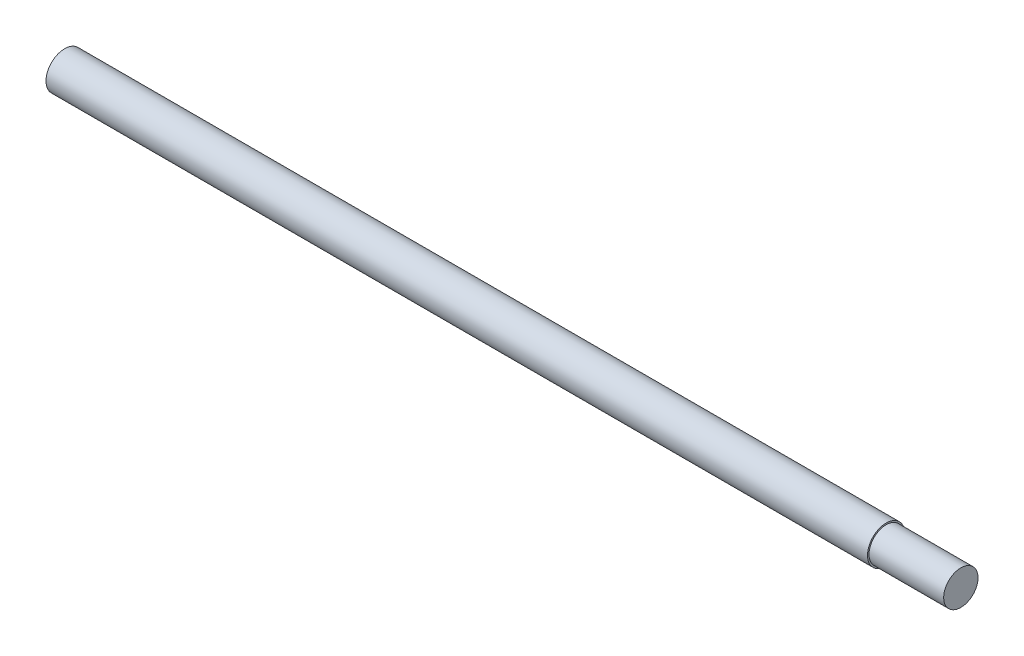
ISO-10303-21;
HEADER;
FILE_DESCRIPTION(('STEP AP214'),'2;1');
FILE_NAME('part.step','',(''),(''),'','','');
FILE_SCHEMA(('AUTOMOTIVE_DESIGN { 1 0 10303 214 1 1 1 1 }'));
ENDSEC;
DATA;
#1=APPLICATION_CONTEXT('core data for automotive mechanical design processes');
#2=APPLICATION_PROTOCOL_DEFINITION('international standard','automotive_design',2000,#1);
#3=PRODUCT_CONTEXT('',#1,'mechanical');
#4=PRODUCT('Part','Part','',(#3));
#5=PRODUCT_RELATED_PRODUCT_CATEGORY('part','',(#4));
#6=PRODUCT_DEFINITION_FORMATION('','',#4);
#7=PRODUCT_DEFINITION_CONTEXT('part definition',#1,'design');
#8=PRODUCT_DEFINITION('design','',#6,#7);
#9=PRODUCT_DEFINITION_SHAPE('','',#8);
#10=(LENGTH_UNIT() NAMED_UNIT(*) SI_UNIT(.MILLI.,.METRE.));
#11=(NAMED_UNIT(*) PLANE_ANGLE_UNIT() SI_UNIT($,.RADIAN.));
#12=(NAMED_UNIT(*) SI_UNIT($,.STERADIAN.) SOLID_ANGLE_UNIT());
#13=UNCERTAINTY_MEASURE_WITH_UNIT(LENGTH_MEASURE(1.E-05),#10,'distance_accuracy_value','');
#14=(GEOMETRIC_REPRESENTATION_CONTEXT(3) GLOBAL_UNCERTAINTY_ASSIGNED_CONTEXT((#13)) GLOBAL_UNIT_ASSIGNED_CONTEXT((#10,
#11,#12)) REPRESENTATION_CONTEXT('',''));
#15=CARTESIAN_POINT('',(0.,0.,0.));
#16=DIRECTION('',(0.,0.,1.));
#17=DIRECTION('',(1.,0.,0.));
#18=AXIS2_PLACEMENT_3D('',#15,#16,#17);
#19=CARTESIAN_POINT('',(57.4356523684052,0.,3.65592978704446));
#20=DIRECTION('',(1.,0.,0.));
#21=DIRECTION('',(0.,0.,-1.));
#22=AXIS2_PLACEMENT_3D('',#19,#20,#21);
#23=PLANE('',#22);
#24=CARTESIAN_POINT('',(57.4356523684052,0.,3.65592978704446));
#25=DIRECTION('',(-1.,0.,0.));
#26=DIRECTION('',(0.,0.,1.));
#27=AXIS2_PLACEMENT_3D('',#24,#25,#26);
#28=CIRCLE('',#27,2.3);
#29=CARTESIAN_POINT('',(57.4356523684052,0.,5.95592978704446));
#30=VERTEX_POINT('',#29);
#31=EDGE_CURVE('E10',#30,#30,#28,.T.);
#32=ORIENTED_EDGE('',*,*,#31,.F.);
#33=EDGE_LOOP('',(#32));
#34=FACE_BOUND('',#33,.T.);
#35=ADVANCED_FACE('F31',(#34),#23,.T.);
#36=CARTESIAN_POINT('',(-62.5643476315948,0.,3.65592978704446));
#37=DIRECTION('',(-1.,0.,0.));
#38=DIRECTION('',(0.,0.,1.));
#39=AXIS2_PLACEMENT_3D('',#36,#37,#38);
#40=CYLINDRICAL_SURFACE('',#39,2.3);
#41=ORIENTED_EDGE('',*,*,#31,.T.);
#42=EDGE_LOOP('',(#41));
#43=FACE_BOUND('',#42,.T.);
#44=CARTESIAN_POINT('',(47.4356523684052,0.,3.65592978704446));
#45=DIRECTION('',(-1.,0.,0.));
#46=DIRECTION('',(0.,0.,1.));
#47=AXIS2_PLACEMENT_3D('',#44,#45,#46);
#48=CIRCLE('',#47,2.3);
#49=CARTESIAN_POINT('',(47.4356523684052,0.,5.95592978704446));
#50=VERTEX_POINT('',#49);
#51=EDGE_CURVE('E37',#50,#50,#48,.T.);
#52=ORIENTED_EDGE('',*,*,#51,.F.);
#53=EDGE_LOOP('',(#52));
#54=FACE_BOUND('',#53,.T.);
#55=ADVANCED_FACE('F63',(#43,#54),#40,.T.);
#56=CARTESIAN_POINT('',(47.4356523684052,0.,5.95592978704446));
#57=DIRECTION('',(1.,0.,0.));
#58=DIRECTION('',(0.,0.,-1.));
#59=AXIS2_PLACEMENT_3D('',#56,#57,#58);
#60=PLANE('',#59);
#61=ORIENTED_EDGE('',*,*,#51,.T.);
#62=EDGE_LOOP('',(#61));
#63=FACE_BOUND('',#62,.T.);
#64=CARTESIAN_POINT('',(47.4356523684052,0.,3.65592978704446));
#65=DIRECTION('',(-1.,0.,0.));
#66=DIRECTION('',(0.,0.,1.));
#67=AXIS2_PLACEMENT_3D('',#64,#65,#66);
#68=CIRCLE('',#67,2.49999999999999);
#69=CARTESIAN_POINT('',(47.4356523684052,0.,6.15592978704445));
#70=VERTEX_POINT('',#69);
#71=EDGE_CURVE('E41',#70,#70,#68,.T.);
#72=ORIENTED_EDGE('',*,*,#71,.F.);
#73=EDGE_LOOP('',(#72));
#74=FACE_BOUND('',#73,.T.);
#75=ADVANCED_FACE('F55',(#63,#74),#60,.T.);
#76=CARTESIAN_POINT('',(-62.5643476315948,0.,3.65592978704446));
#77=DIRECTION('',(-1.,0.,0.));
#78=DIRECTION('',(0.,0.,1.));
#79=AXIS2_PLACEMENT_3D('',#76,#77,#78);
#80=CYLINDRICAL_SURFACE('',#79,2.49999999999999);
#81=ORIENTED_EDGE('',*,*,#71,.T.);
#82=EDGE_LOOP('',(#81));
#83=FACE_BOUND('',#82,.T.);
#84=CARTESIAN_POINT('',(-62.5643476315948,0.,3.65592978704446));
#85=DIRECTION('',(-1.,0.,0.));
#86=DIRECTION('',(0.,0.,1.));
#87=AXIS2_PLACEMENT_3D('',#84,#85,#86);
#88=CIRCLE('',#87,2.5);
#89=CARTESIAN_POINT('',(-62.5643476315948,0.,6.15592978704446));
#90=VERTEX_POINT('',#89);
#91=EDGE_CURVE('E45',#90,#90,#88,.T.);
#92=ORIENTED_EDGE('',*,*,#91,.F.);
#93=EDGE_LOOP('',(#92));
#94=FACE_BOUND('',#93,.T.);
#95=ADVANCED_FACE('F53',(#83,#94),#80,.T.);
#96=CARTESIAN_POINT('',(-62.5643476315948,0.,6.15592978704446));
#97=DIRECTION('',(-1.,0.,0.));
#98=DIRECTION('',(0.,0.,1.));
#99=AXIS2_PLACEMENT_3D('',#96,#97,#98);
#100=PLANE('',#99);
#101=ORIENTED_EDGE('',*,*,#91,.T.);
#102=EDGE_LOOP('',(#101));
#103=FACE_BOUND('',#102,.T.);
#104=ADVANCED_FACE('F51',(#103),#100,.T.);
#105=CLOSED_SHELL('',(#35,#55,#75,#95,#104));
#106=MANIFOLD_SOLID_BREP('B2',#105);
#107=ADVANCED_BREP_SHAPE_REPRESENTATION('',(#18,#106),#14);
#108=SHAPE_DEFINITION_REPRESENTATION(#9,#107);
ENDSEC;
END-ISO-10303-21;
